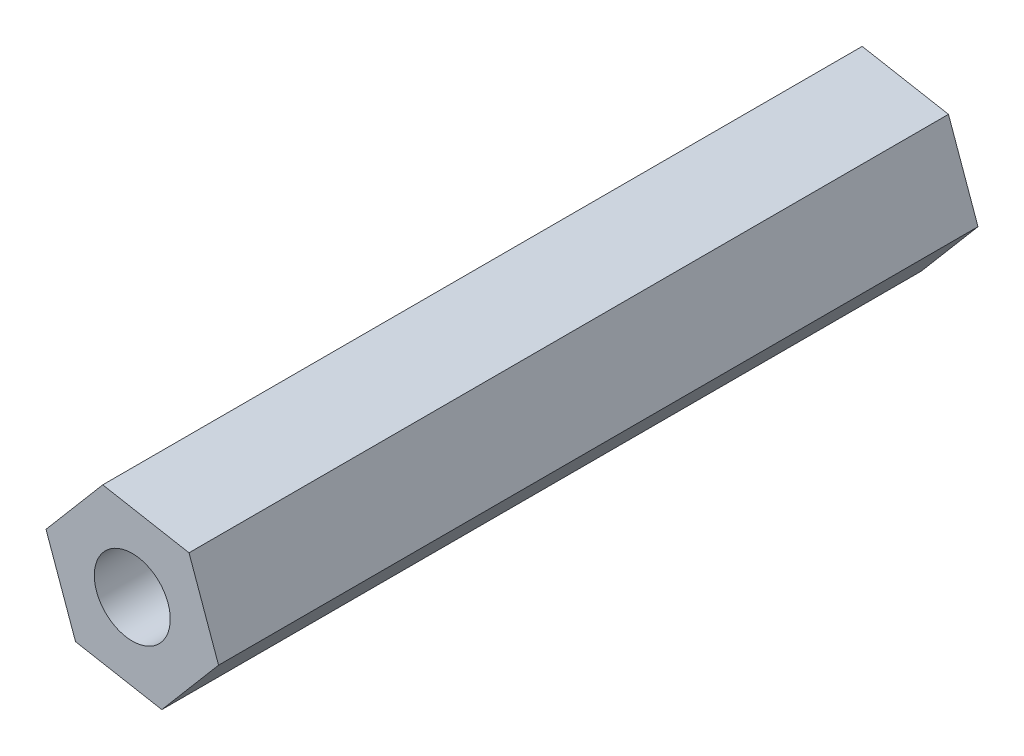
ISO-10303-21;
HEADER;
FILE_DESCRIPTION(('STEP AP214'),'2;1');
FILE_NAME('part.step','',(''),(''),'','','');
FILE_SCHEMA(('AUTOMOTIVE_DESIGN { 1 0 10303 214 1 1 1 1 }'));
ENDSEC;
DATA;
#1=APPLICATION_CONTEXT('core data for automotive mechanical design processes');
#2=APPLICATION_PROTOCOL_DEFINITION('international standard','automotive_design',2000,#1);
#3=PRODUCT_CONTEXT('',#1,'mechanical');
#4=PRODUCT('Part','Part','',(#3));
#5=PRODUCT_RELATED_PRODUCT_CATEGORY('part','',(#4));
#6=PRODUCT_DEFINITION_FORMATION('','',#4);
#7=PRODUCT_DEFINITION_CONTEXT('part definition',#1,'design');
#8=PRODUCT_DEFINITION('design','',#6,#7);
#9=PRODUCT_DEFINITION_SHAPE('','',#8);
#10=(LENGTH_UNIT() NAMED_UNIT(*) SI_UNIT(.MILLI.,.METRE.));
#11=(NAMED_UNIT(*) PLANE_ANGLE_UNIT() SI_UNIT($,.RADIAN.));
#12=(NAMED_UNIT(*) SI_UNIT($,.STERADIAN.) SOLID_ANGLE_UNIT());
#13=UNCERTAINTY_MEASURE_WITH_UNIT(LENGTH_MEASURE(1.E-05),#10,'distance_accuracy_value','');
#14=(GEOMETRIC_REPRESENTATION_CONTEXT(3) GLOBAL_UNCERTAINTY_ASSIGNED_CONTEXT((#13)) GLOBAL_UNIT_ASSIGNED_CONTEXT((#10,
#11,#12)) REPRESENTATION_CONTEXT('',''));
#15=CARTESIAN_POINT('',(0.,0.,0.));
#16=DIRECTION('',(0.,0.,1.));
#17=DIRECTION('',(1.,0.,0.));
#18=AXIS2_PLACEMENT_3D('',#15,#16,#17);
#19=CARTESIAN_POINT('',(14.100105118259,-7.40552271774973,30.));
#20=DIRECTION('',(-0.941553473498977,-0.336863557753005,0.));
#21=DIRECTION('',(0.336863557753005,-0.941553473498977,0.));
#22=AXIS2_PLACEMENT_3D('',#19,#20,#21);
#23=PLANE('',#22);
#24=DIRECTION('',(-0.336863557753005,0.941553473498977,0.));
#25=VECTOR('',#24,1.);
#26=CARTESIAN_POINT('',(14.100105118259,-7.40552271774973,0.));
#27=LINE('',#26,#25);
#28=CARTESIAN_POINT('',(14.100105118259,-7.40552271774973,0.));
#29=VERTEX_POINT('',#28);
#30=CARTESIAN_POINT('',(12.9331755237658,-4.14388580946336,0.));
#31=VERTEX_POINT('',#30);
#32=EDGE_CURVE('E116',#29,#31,#27,.T.);
#33=ORIENTED_EDGE('',*,*,#32,.T.);
#34=DIRECTION('',(0.,0.,-1.));
#35=VECTOR('',#34,1.);
#36=CARTESIAN_POINT('',(12.9331755237658,-4.14388580946336,30.));
#37=LINE('',#36,#35);
#38=CARTESIAN_POINT('',(12.9331755237658,-4.14388580946336,30.));
#39=VERTEX_POINT('',#38);
#40=EDGE_CURVE('E11',#39,#31,#37,.T.);
#41=ORIENTED_EDGE('',*,*,#40,.F.);
#42=DIRECTION('',(-0.336863557753005,0.941553473498977,0.));
#43=VECTOR('',#42,1.);
#44=CARTESIAN_POINT('',(14.100105118259,-7.40552271774973,30.));
#45=LINE('',#44,#43);
#46=CARTESIAN_POINT('',(14.100105118259,-7.40552271774973,30.));
#47=VERTEX_POINT('',#46);
#48=EDGE_CURVE('E127',#47,#39,#45,.T.);
#49=ORIENTED_EDGE('',*,*,#48,.F.);
#50=DIRECTION('',(0.,0.,-1.));
#51=VECTOR('',#50,1.);
#52=CARTESIAN_POINT('',(14.100105118259,-7.40552271774973,30.));
#53=LINE('',#52,#51);
#54=EDGE_CURVE('E112',#47,#29,#53,.T.);
#55=ORIENTED_EDGE('',*,*,#54,.T.);
#56=EDGE_LOOP('',(#33,#41,#49,#55));
#57=FACE_BOUND('',#56,.T.);
#58=ADVANCED_FACE('F32',(#57),#23,.F.);
#59=CARTESIAN_POINT('',(12.9331755237658,-4.14388580946336,30.));
#60=DIRECTION('',(-0.17904433812618,-0.983841005948094,0.));
#61=DIRECTION('',(0.983841005948094,-0.17904433812618,0.));
#62=AXIS2_PLACEMENT_3D('',#59,#60,#61);
#63=PLANE('',#62);
#64=DIRECTION('',(-0.983841005948094,0.17904433812618,0.));
#65=VECTOR('',#64,1.);
#66=CARTESIAN_POINT('',(12.9331755237658,-4.14388580946336,0.));
#67=LINE('',#66,#65);
#68=CARTESIAN_POINT('',(9.52505030602222,-3.52365802857919,0.));
#69=VERTEX_POINT('',#68);
#70=EDGE_CURVE('E119',#31,#69,#67,.T.);
#71=ORIENTED_EDGE('',*,*,#70,.T.);
#72=DIRECTION('',(0.,0.,-1.));
#73=VECTOR('',#72,1.);
#74=CARTESIAN_POINT('',(9.52505030602222,-3.52365802857919,30.));
#75=LINE('',#74,#73);
#76=CARTESIAN_POINT('',(9.52505030602222,-3.52365802857919,30.));
#77=VERTEX_POINT('',#76);
#78=EDGE_CURVE('E40',#77,#69,#75,.T.);
#79=ORIENTED_EDGE('',*,*,#78,.F.);
#80=DIRECTION('',(-0.983841005948094,0.17904433812618,0.));
#81=VECTOR('',#80,1.);
#82=CARTESIAN_POINT('',(12.9331755237658,-4.14388580946336,30.));
#83=LINE('',#82,#81);
#84=EDGE_CURVE('E85',#39,#77,#83,.T.);
#85=ORIENTED_EDGE('',*,*,#84,.F.);
#86=ORIENTED_EDGE('',*,*,#40,.T.);
#87=EDGE_LOOP('',(#71,#79,#85,#86));
#88=FACE_BOUND('',#87,.T.);
#89=ADVANCED_FACE('F152',(#88),#63,.F.);
#90=CARTESIAN_POINT('',(9.52505030602222,-3.52365802857919,30.));
#91=DIRECTION('',(0.762509135372797,-0.64697744819509,0.));
#92=DIRECTION('',(0.64697744819509,0.762509135372797,0.));
#93=AXIS2_PLACEMENT_3D('',#90,#91,#92);
#94=PLANE('',#93);
#95=DIRECTION('',(-0.64697744819509,-0.762509135372797,0.));
#96=VECTOR('',#95,1.);
#97=CARTESIAN_POINT('',(9.52505030602222,-3.52365802857919,0.));
#98=LINE('',#97,#96);
#99=CARTESIAN_POINT('',(7.28385468277191,-6.16506715598138,0.));
#100=VERTEX_POINT('',#99);
#101=EDGE_CURVE('E122',#69,#100,#98,.T.);
#102=ORIENTED_EDGE('',*,*,#101,.T.);
#103=DIRECTION('',(0.,0.,-1.));
#104=VECTOR('',#103,1.);
#105=CARTESIAN_POINT('',(7.28385468277191,-6.16506715598138,30.));
#106=LINE('',#105,#104);
#107=CARTESIAN_POINT('',(7.28385468277191,-6.16506715598138,30.));
#108=VERTEX_POINT('',#107);
#109=EDGE_CURVE('E107',#108,#100,#106,.T.);
#110=ORIENTED_EDGE('',*,*,#109,.F.);
#111=DIRECTION('',(-0.64697744819509,-0.762509135372797,0.));
#112=VECTOR('',#111,1.);
#113=CARTESIAN_POINT('',(9.52505030602222,-3.52365802857919,30.));
#114=LINE('',#113,#112);
#115=EDGE_CURVE('E98',#77,#108,#114,.T.);
#116=ORIENTED_EDGE('',*,*,#115,.F.);
#117=ORIENTED_EDGE('',*,*,#78,.T.);
#118=EDGE_LOOP('',(#102,#110,#116,#117));
#119=FACE_BOUND('',#118,.T.);
#120=ADVANCED_FACE('F133',(#119),#94,.F.);
#121=CARTESIAN_POINT('',(7.28385468277191,-6.16506715598138,30.));
#122=DIRECTION('',(0.941553473498977,0.336863557753005,0.));
#123=DIRECTION('',(-0.336863557753005,0.941553473498977,0.));
#124=AXIS2_PLACEMENT_3D('',#121,#122,#123);
#125=PLANE('',#124);
#126=DIRECTION('',(0.336863557753005,-0.941553473498977,0.));
#127=VECTOR('',#126,1.);
#128=CARTESIAN_POINT('',(7.28385468277191,-6.16506715598138,0.));
#129=LINE('',#128,#127);
#130=CARTESIAN_POINT('',(8.45078427726515,-9.42670406426776,0.));
#131=VERTEX_POINT('',#130);
#132=EDGE_CURVE('E106',#100,#131,#129,.T.);
#133=ORIENTED_EDGE('',*,*,#132,.T.);
#134=DIRECTION('',(0.,0.,-1.));
#135=VECTOR('',#134,1.);
#136=CARTESIAN_POINT('',(8.45078427726515,-9.42670406426776,30.));
#137=LINE('',#136,#135);
#138=CARTESIAN_POINT('',(8.45078427726515,-9.42670406426776,30.));
#139=VERTEX_POINT('',#138);
#140=EDGE_CURVE('E103',#139,#131,#137,.T.);
#141=ORIENTED_EDGE('',*,*,#140,.F.);
#142=DIRECTION('',(0.336863557753005,-0.941553473498977,0.));
#143=VECTOR('',#142,1.);
#144=CARTESIAN_POINT('',(7.28385468277191,-6.16506715598138,30.));
#145=LINE('',#144,#143);
#146=EDGE_CURVE('E92',#108,#139,#145,.T.);
#147=ORIENTED_EDGE('',*,*,#146,.F.);
#148=ORIENTED_EDGE('',*,*,#109,.T.);
#149=EDGE_LOOP('',(#133,#141,#147,#148));
#150=FACE_BOUND('',#149,.T.);
#151=ADVANCED_FACE('F104',(#150),#125,.F.);
#152=CARTESIAN_POINT('',(8.45078427726515,-9.42670406426776,30.));
#153=DIRECTION('',(0.17904433812618,0.983841005948094,0.));
#154=DIRECTION('',(-0.983841005948094,0.17904433812618,0.));
#155=AXIS2_PLACEMENT_3D('',#152,#153,#154);
#156=PLANE('',#155);
#157=DIRECTION('',(0.983841005948094,-0.17904433812618,0.));
#158=VECTOR('',#157,1.);
#159=CARTESIAN_POINT('',(8.45078427726515,-9.42670406426776,0.));
#160=LINE('',#159,#158);
#161=CARTESIAN_POINT('',(11.8589094950087,-10.0469318451519,0.));
#162=VERTEX_POINT('',#161);
#163=EDGE_CURVE('E71',#131,#162,#160,.T.);
#164=ORIENTED_EDGE('',*,*,#163,.T.);
#165=DIRECTION('',(0.,0.,-1.));
#166=VECTOR('',#165,1.);
#167=CARTESIAN_POINT('',(11.8589094950087,-10.0469318451519,30.));
#168=LINE('',#167,#166);
#169=CARTESIAN_POINT('',(11.8589094950087,-10.0469318451519,30.));
#170=VERTEX_POINT('',#169);
#171=EDGE_CURVE('E108',#170,#162,#168,.T.);
#172=ORIENTED_EDGE('',*,*,#171,.F.);
#173=DIRECTION('',(0.983841005948094,-0.17904433812618,0.));
#174=VECTOR('',#173,1.);
#175=CARTESIAN_POINT('',(8.45078427726515,-9.42670406426776,30.));
#176=LINE('',#175,#174);
#177=EDGE_CURVE('E96',#139,#170,#176,.T.);
#178=ORIENTED_EDGE('',*,*,#177,.F.);
#179=ORIENTED_EDGE('',*,*,#140,.T.);
#180=EDGE_LOOP('',(#164,#172,#178,#179));
#181=FACE_BOUND('',#180,.T.);
#182=ADVANCED_FACE('F110',(#181),#156,.F.);
#183=CARTESIAN_POINT('',(11.8589094950087,-10.0469318451519,30.));
#184=DIRECTION('',(-0.762509135372797,0.64697744819509,0.));
#185=DIRECTION('',(-0.64697744819509,-0.762509135372797,0.));
#186=AXIS2_PLACEMENT_3D('',#183,#184,#185);
#187=PLANE('',#186);
#188=DIRECTION('',(0.64697744819509,0.762509135372797,0.));
#189=VECTOR('',#188,1.);
#190=CARTESIAN_POINT('',(11.8589094950087,-10.0469318451519,0.));
#191=LINE('',#190,#189);
#192=EDGE_CURVE('E77',#162,#29,#191,.T.);
#193=ORIENTED_EDGE('',*,*,#192,.T.);
#194=ORIENTED_EDGE('',*,*,#54,.F.);
#195=DIRECTION('',(0.64697744819509,0.762509135372797,0.));
#196=VECTOR('',#195,1.);
#197=CARTESIAN_POINT('',(11.8589094950087,-10.0469318451519,30.));
#198=LINE('',#197,#196);
#199=EDGE_CURVE('E48',#170,#47,#198,.T.);
#200=ORIENTED_EDGE('',*,*,#199,.F.);
#201=ORIENTED_EDGE('',*,*,#171,.T.);
#202=EDGE_LOOP('',(#193,#194,#200,#201));
#203=FACE_BOUND('',#202,.T.);
#204=ADVANCED_FACE('F140',(#203),#187,.F.);
#205=CARTESIAN_POINT('',(0.,0.,30.));
#206=DIRECTION('',(0.,0.,1.));
#207=DIRECTION('',(1.,0.,0.));
#208=AXIS2_PLACEMENT_3D('',#205,#206,#207);
#209=PLANE('',#208);
#210=CARTESIAN_POINT('',(10.6919799005155,-6.78529493686556,30.));
#211=DIRECTION('',(0.,0.,1.));
#212=DIRECTION('',(1.,0.,0.));
#213=AXIS2_PLACEMENT_3D('',#210,#211,#212);
#214=CIRCLE('',#213,1.5);
#215=CARTESIAN_POINT('',(12.1919799005155,-6.78529493686556,30.));
#216=VERTEX_POINT('',#215);
#217=EDGE_CURVE('E120',#216,#216,#214,.T.);
#218=ORIENTED_EDGE('',*,*,#217,.F.);
#219=EDGE_LOOP('',(#218));
#220=FACE_BOUND('',#219,.T.);
#221=ORIENTED_EDGE('',*,*,#48,.T.);
#222=ORIENTED_EDGE('',*,*,#84,.T.);
#223=ORIENTED_EDGE('',*,*,#115,.T.);
#224=ORIENTED_EDGE('',*,*,#146,.T.);
#225=ORIENTED_EDGE('',*,*,#177,.T.);
#226=ORIENTED_EDGE('',*,*,#199,.T.);
#227=EDGE_LOOP('',(#221,#222,#223,#224,#225,#226));
#228=FACE_BOUND('',#227,.T.);
#229=ADVANCED_FACE('F94',(#220,#228),#209,.T.);
#230=CARTESIAN_POINT('',(0.,0.,0.));
#231=DIRECTION('',(0.,0.,1.));
#232=DIRECTION('',(1.,0.,0.));
#233=AXIS2_PLACEMENT_3D('',#230,#231,#232);
#234=PLANE('',#233);
#235=CARTESIAN_POINT('',(10.6919799005155,-6.78529493686556,0.));
#236=DIRECTION('',(0.,0.,-1.));
#237=DIRECTION('',(-1.,0.,0.));
#238=AXIS2_PLACEMENT_3D('',#235,#236,#237);
#239=CIRCLE('',#238,1.5);
#240=CARTESIAN_POINT('',(9.19197990051546,-6.78529493686556,0.));
#241=VERTEX_POINT('',#240);
#242=EDGE_CURVE('E207',#241,#241,#239,.T.);
#243=ORIENTED_EDGE('',*,*,#242,.F.);
#244=EDGE_LOOP('',(#243));
#245=FACE_BOUND('',#244,.T.);
#246=ORIENTED_EDGE('',*,*,#32,.F.);
#247=ORIENTED_EDGE('',*,*,#192,.F.);
#248=ORIENTED_EDGE('',*,*,#163,.F.);
#249=ORIENTED_EDGE('',*,*,#132,.F.);
#250=ORIENTED_EDGE('',*,*,#101,.F.);
#251=ORIENTED_EDGE('',*,*,#70,.F.);
#252=EDGE_LOOP('',(#246,#247,#248,#249,#250,#251));
#253=FACE_BOUND('',#252,.T.);
#254=ADVANCED_FACE('F136',(#245,#253),#234,.F.);
#255=CARTESIAN_POINT('',(10.6919799005155,-6.78529493686556,40.));
#256=DIRECTION('',(0.,0.,-1.));
#257=DIRECTION('',(-1.,0.,0.));
#258=AXIS2_PLACEMENT_3D('',#255,#256,#257);
#259=CYLINDRICAL_SURFACE('',#258,1.5);
#260=ORIENTED_EDGE('',*,*,#217,.T.);
#261=EDGE_LOOP('',(#260));
#262=FACE_BOUND('',#261,.T.);
#263=ORIENTED_EDGE('',*,*,#242,.T.);
#264=EDGE_LOOP('',(#263));
#265=FACE_BOUND('',#264,.T.);
#266=ADVANCED_FACE('F189',(#262,#265),#259,.F.);
#267=CLOSED_SHELL('',(#58,#89,#120,#151,#182,#204,#229,#254,#266));
#268=MANIFOLD_SOLID_BREP('B2',#267);
#269=ADVANCED_BREP_SHAPE_REPRESENTATION('',(#18,#268),#14);
#270=SHAPE_DEFINITION_REPRESENTATION(#9,#269);
ENDSEC;
END-ISO-10303-21;
